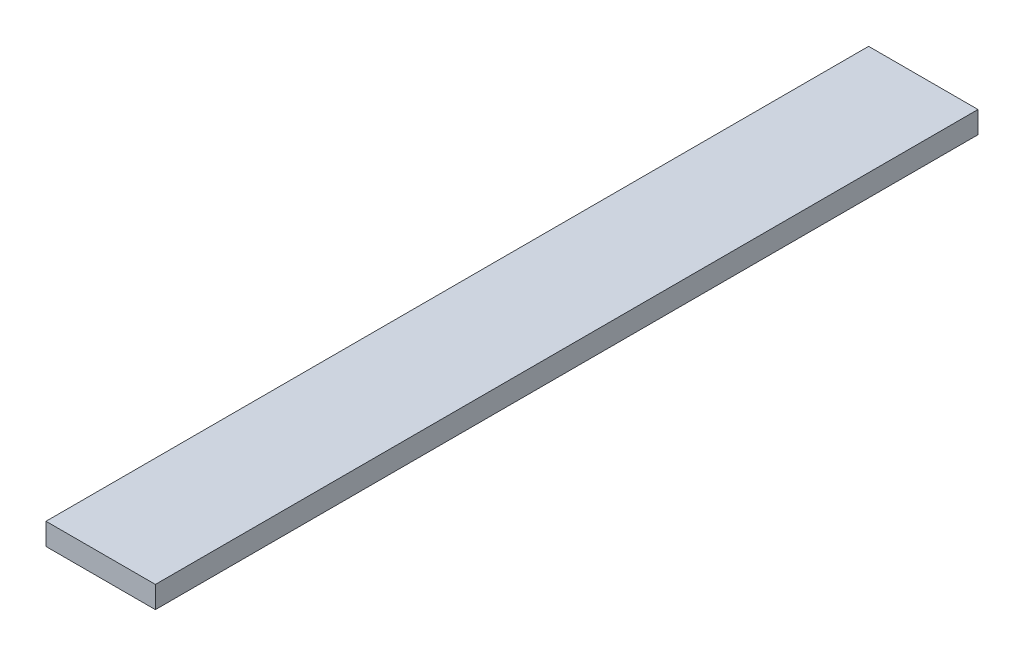
ISO-10303-21;
HEADER;
FILE_DESCRIPTION(('STEP AP214'),'2;1');
FILE_NAME('part.step','',(''),(''),'','','');
FILE_SCHEMA(('AUTOMOTIVE_DESIGN { 1 0 10303 214 1 1 1 1 }'));
ENDSEC;
DATA;
#1=APPLICATION_CONTEXT('core data for automotive mechanical design processes');
#2=APPLICATION_PROTOCOL_DEFINITION('international standard','automotive_design',2000,#1);
#3=PRODUCT_CONTEXT('',#1,'mechanical');
#4=PRODUCT('Part','Part','',(#3));
#5=PRODUCT_RELATED_PRODUCT_CATEGORY('part','',(#4));
#6=PRODUCT_DEFINITION_FORMATION('','',#4);
#7=PRODUCT_DEFINITION_CONTEXT('part definition',#1,'design');
#8=PRODUCT_DEFINITION('design','',#6,#7);
#9=PRODUCT_DEFINITION_SHAPE('','',#8);
#10=(LENGTH_UNIT() NAMED_UNIT(*) SI_UNIT(.MILLI.,.METRE.));
#11=(NAMED_UNIT(*) PLANE_ANGLE_UNIT() SI_UNIT($,.RADIAN.));
#12=(NAMED_UNIT(*) SI_UNIT($,.STERADIAN.) SOLID_ANGLE_UNIT());
#13=UNCERTAINTY_MEASURE_WITH_UNIT(LENGTH_MEASURE(1.E-05),#10,'distance_accuracy_value','');
#14=(GEOMETRIC_REPRESENTATION_CONTEXT(3) GLOBAL_UNCERTAINTY_ASSIGNED_CONTEXT((#13)) GLOBAL_UNIT_ASSIGNED_CONTEXT((#10,
#11,#12)) REPRESENTATION_CONTEXT('',''));
#15=CARTESIAN_POINT('',(0.,0.,0.));
#16=DIRECTION('',(0.,0.,1.));
#17=DIRECTION('',(1.,0.,0.));
#18=AXIS2_PLACEMENT_3D('',#15,#16,#17);
#19=CARTESIAN_POINT('',(0.,1.42999999999,0.));
#20=DIRECTION('',(0.,-1.,0.));
#21=DIRECTION('',(1.,0.,0.));
#22=AXIS2_PLACEMENT_3D('',#19,#20,#21);
#23=PLANE('',#22);
#24=DIRECTION('',(1.,0.,0.));
#25=VECTOR('',#24,1.);
#26=CARTESIAN_POINT('',(0.,1.42999999999,2.075));
#27=LINE('',#26,#25);
#28=CARTESIAN_POINT('',(-1.625,1.42999999999,2.075));
#29=VERTEX_POINT('',#28);
#30=CARTESIAN_POINT('',(-1.875,1.42999999999,2.075));
#31=VERTEX_POINT('',#30);
#32=EDGE_CURVE('E19',#29,#31,#27,.F.);
#33=ORIENTED_EDGE('',*,*,#32,.F.);
#34=DIRECTION('',(0.,0.,1.));
#35=VECTOR('',#34,1.);
#36=CARTESIAN_POINT('',(-1.625,1.42999999999,0.195));
#37=LINE('',#36,#35);
#38=CARTESIAN_POINT('',(-1.625,1.42999999999,0.195));
#39=VERTEX_POINT('',#38);
#40=EDGE_CURVE('E68',#29,#39,#37,.F.);
#41=ORIENTED_EDGE('',*,*,#40,.T.);
#42=DIRECTION('',(1.,0.,0.));
#43=VECTOR('',#42,1.);
#44=CARTESIAN_POINT('',(-1.875,1.42999999999,0.195));
#45=LINE('',#44,#43);
#46=CARTESIAN_POINT('',(-1.875,1.42999999999,0.195));
#47=VERTEX_POINT('',#46);
#48=EDGE_CURVE('E55',#39,#47,#45,.F.);
#49=ORIENTED_EDGE('',*,*,#48,.T.);
#50=DIRECTION('',(0.,0.,1.));
#51=VECTOR('',#50,1.);
#52=CARTESIAN_POINT('',(-1.875,1.42999999999,0.195));
#53=LINE('',#52,#51);
#54=EDGE_CURVE('E61',#47,#31,#53,.T.);
#55=ORIENTED_EDGE('',*,*,#54,.T.);
#56=EDGE_LOOP('',(#33,#41,#49,#55));
#57=FACE_BOUND('',#56,.T.);
#58=ADVANCED_FACE('F16',(#57),#23,.F.);
#59=CARTESIAN_POINT('',(-1.875,1.37999999999,0.195));
#60=DIRECTION('',(1.,0.,0.));
#61=DIRECTION('',(0.,1.,0.));
#62=AXIS2_PLACEMENT_3D('',#59,#60,#61);
#63=PLANE('',#62);
#64=DIRECTION('',(0.,1.,0.));
#65=VECTOR('',#64,1.);
#66=CARTESIAN_POINT('',(-1.875,1.37999999999,0.195));
#67=LINE('',#66,#65);
#68=CARTESIAN_POINT('',(-1.875,1.37999999999,0.195));
#69=VERTEX_POINT('',#68);
#70=EDGE_CURVE('E63',#47,#69,#67,.F.);
#71=ORIENTED_EDGE('',*,*,#70,.T.);
#72=DIRECTION('',(0.,0.,1.));
#73=VECTOR('',#72,1.);
#74=CARTESIAN_POINT('',(-1.875,1.37999999999,0.));
#75=LINE('',#74,#73);
#76=CARTESIAN_POINT('',(-1.875,1.37999999999,2.075));
#77=VERTEX_POINT('',#76);
#78=EDGE_CURVE('E82',#77,#69,#75,.F.);
#79=ORIENTED_EDGE('',*,*,#78,.F.);
#80=DIRECTION('',(0.,1.,0.));
#81=VECTOR('',#80,1.);
#82=CARTESIAN_POINT('',(-1.875,1.37999999999,2.075));
#83=LINE('',#82,#81);
#84=EDGE_CURVE('E66',#77,#31,#83,.T.);
#85=ORIENTED_EDGE('',*,*,#84,.T.);
#86=ORIENTED_EDGE('',*,*,#54,.F.);
#87=EDGE_LOOP('',(#71,#79,#85,#86));
#88=FACE_BOUND('',#87,.T.);
#89=ADVANCED_FACE('F62',(#88),#63,.F.);
#90=CARTESIAN_POINT('',(-1.875,1.37999999999,0.195));
#91=DIRECTION('',(0.,0.,1.));
#92=DIRECTION('',(1.,0.,0.));
#93=AXIS2_PLACEMENT_3D('',#90,#91,#92);
#94=PLANE('',#93);
#95=DIRECTION('',(0.,-1.,0.));
#96=VECTOR('',#95,1.);
#97=CARTESIAN_POINT('',(-1.625,1.37999999999,0.195));
#98=LINE('',#97,#96);
#99=CARTESIAN_POINT('',(-1.625,1.37999999999,0.195));
#100=VERTEX_POINT('',#99);
#101=EDGE_CURVE('E70',#39,#100,#98,.T.);
#102=ORIENTED_EDGE('',*,*,#101,.T.);
#103=DIRECTION('',(1.,0.,0.));
#104=VECTOR('',#103,1.);
#105=CARTESIAN_POINT('',(0.,1.37999999999,0.195));
#106=LINE('',#105,#104);
#107=EDGE_CURVE('E74',#69,#100,#106,.T.);
#108=ORIENTED_EDGE('',*,*,#107,.F.);
#109=ORIENTED_EDGE('',*,*,#70,.F.);
#110=ORIENTED_EDGE('',*,*,#48,.F.);
#111=EDGE_LOOP('',(#102,#108,#109,#110));
#112=FACE_BOUND('',#111,.T.);
#113=ADVANCED_FACE('F72',(#112),#94,.F.);
#114=CARTESIAN_POINT('',(-1.625,1.37999999999,0.195));
#115=DIRECTION('',(-1.,0.,0.));
#116=DIRECTION('',(0.,-1.,0.));
#117=AXIS2_PLACEMENT_3D('',#114,#115,#116);
#118=PLANE('',#117);
#119=DIRECTION('',(0.,1.,0.));
#120=VECTOR('',#119,1.);
#121=CARTESIAN_POINT('',(-1.625,1.37999999999,2.075));
#122=LINE('',#121,#120);
#123=CARTESIAN_POINT('',(-1.625,1.37999999999,2.075));
#124=VERTEX_POINT('',#123);
#125=EDGE_CURVE('E34',#29,#124,#122,.F.);
#126=ORIENTED_EDGE('',*,*,#125,.T.);
#127=DIRECTION('',(0.,0.,1.));
#128=VECTOR('',#127,1.);
#129=CARTESIAN_POINT('',(-1.625,1.37999999999,0.));
#130=LINE('',#129,#128);
#131=EDGE_CURVE('E25',#100,#124,#130,.T.);
#132=ORIENTED_EDGE('',*,*,#131,.F.);
#133=ORIENTED_EDGE('',*,*,#101,.F.);
#134=ORIENTED_EDGE('',*,*,#40,.F.);
#135=EDGE_LOOP('',(#126,#132,#133,#134));
#136=FACE_BOUND('',#135,.T.);
#137=ADVANCED_FACE('F88',(#136),#118,.F.);
#138=CARTESIAN_POINT('',(-1.875,1.37999999999,2.075));
#139=DIRECTION('',(0.,0.,-1.));
#140=DIRECTION('',(-1.,0.,0.));
#141=AXIS2_PLACEMENT_3D('',#138,#139,#140);
#142=PLANE('',#141);
#143=ORIENTED_EDGE('',*,*,#84,.F.);
#144=DIRECTION('',(1.,0.,0.));
#145=VECTOR('',#144,1.);
#146=CARTESIAN_POINT('',(0.,1.37999999999,2.075));
#147=LINE('',#146,#145);
#148=EDGE_CURVE('E11',#124,#77,#147,.F.);
#149=ORIENTED_EDGE('',*,*,#148,.F.);
#150=ORIENTED_EDGE('',*,*,#125,.F.);
#151=ORIENTED_EDGE('',*,*,#32,.T.);
#152=EDGE_LOOP('',(#143,#149,#150,#151));
#153=FACE_BOUND('',#152,.T.);
#154=ADVANCED_FACE('F90',(#153),#142,.F.);
#155=CARTESIAN_POINT('',(0.,1.37999999999,0.));
#156=DIRECTION('',(0.,-1.,0.));
#157=DIRECTION('',(1.,0.,0.));
#158=AXIS2_PLACEMENT_3D('',#155,#156,#157);
#159=PLANE('',#158);
#160=ORIENTED_EDGE('',*,*,#131,.T.);
#161=ORIENTED_EDGE('',*,*,#148,.T.);
#162=ORIENTED_EDGE('',*,*,#78,.T.);
#163=ORIENTED_EDGE('',*,*,#107,.T.);
#164=EDGE_LOOP('',(#160,#161,#162,#163));
#165=FACE_BOUND('',#164,.T.);
#166=ADVANCED_FACE('F87',(#165),#159,.T.);
#167=CLOSED_SHELL('',(#58,#89,#113,#137,#154,#166));
#168=MANIFOLD_SOLID_BREP('B1',#167);
#169=ADVANCED_BREP_SHAPE_REPRESENTATION('',(#18,#168),#14);
#170=SHAPE_DEFINITION_REPRESENTATION(#9,#169);
ENDSEC;
END-ISO-10303-21;
